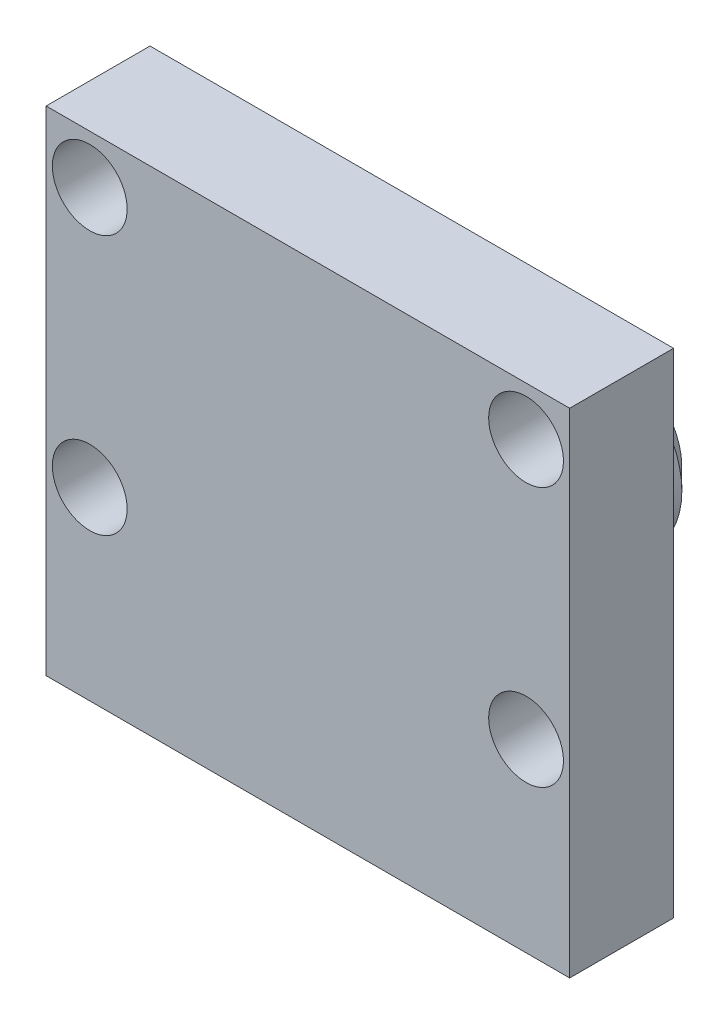
ISO-10303-21;
HEADER;
FILE_DESCRIPTION(('STEP AP214'),'2;1');
FILE_NAME('part.step','',(''),(''),'','','');
FILE_SCHEMA(('AUTOMOTIVE_DESIGN { 1 0 10303 214 1 1 1 1 }'));
ENDSEC;
DATA;
#1=APPLICATION_CONTEXT('core data for automotive mechanical design processes');
#2=APPLICATION_PROTOCOL_DEFINITION('international standard','automotive_design',2000,#1);
#3=PRODUCT_CONTEXT('',#1,'mechanical');
#4=PRODUCT('Part','Part','',(#3));
#5=PRODUCT_RELATED_PRODUCT_CATEGORY('part','',(#4));
#6=PRODUCT_DEFINITION_FORMATION('','',#4);
#7=PRODUCT_DEFINITION_CONTEXT('part definition',#1,'design');
#8=PRODUCT_DEFINITION('design','',#6,#7);
#9=PRODUCT_DEFINITION_SHAPE('','',#8);
#10=(LENGTH_UNIT() NAMED_UNIT(*) SI_UNIT(.MILLI.,.METRE.));
#11=(NAMED_UNIT(*) PLANE_ANGLE_UNIT() SI_UNIT($,.RADIAN.));
#12=(NAMED_UNIT(*) SI_UNIT($,.STERADIAN.) SOLID_ANGLE_UNIT());
#13=UNCERTAINTY_MEASURE_WITH_UNIT(LENGTH_MEASURE(1.E-05),#10,'distance_accuracy_value','');
#14=(GEOMETRIC_REPRESENTATION_CONTEXT(3) GLOBAL_UNCERTAINTY_ASSIGNED_CONTEXT((#13)) GLOBAL_UNIT_ASSIGNED_CONTEXT((#10,
#11,#12)) REPRESENTATION_CONTEXT('',''));
#15=CARTESIAN_POINT('',(0.,0.,0.));
#16=DIRECTION('',(0.,0.,1.));
#17=DIRECTION('',(1.,0.,0.));
#18=AXIS2_PLACEMENT_3D('',#15,#16,#17);
#19=CARTESIAN_POINT('',(0.,39.,-1.92893218813452));
#20=DIRECTION('',(0.,0.,-1.));
#21=DIRECTION('',(-1.,0.,0.));
#22=AXIS2_PLACEMENT_3D('',#19,#20,#21);
#23=CYLINDRICAL_SURFACE('',#22,2.5);
#24=CARTESIAN_POINT('',(0.,39.,-9.));
#25=DIRECTION('',(0.,0.,-1.));
#26=DIRECTION('',(-1.,0.,0.));
#27=AXIS2_PLACEMENT_3D('',#24,#25,#26);
#28=CIRCLE('',#27,2.5);
#29=CARTESIAN_POINT('',(-2.5,39.,-9.));
#30=VERTEX_POINT('',#29);
#31=EDGE_CURVE('E11',#30,#30,#28,.F.);
#32=ORIENTED_EDGE('',*,*,#31,.F.);
#33=EDGE_LOOP('',(#32));
#34=FACE_BOUND('',#33,.T.);
#35=CARTESIAN_POINT('',(0.,39.,-10.));
#36=DIRECTION('',(0.,0.,-1.));
#37=DIRECTION('',(-1.,0.,0.));
#38=AXIS2_PLACEMENT_3D('',#35,#36,#37);
#39=CIRCLE('',#38,2.5);
#40=CARTESIAN_POINT('',(-2.5,39.,-10.));
#41=VERTEX_POINT('',#40);
#42=EDGE_CURVE('E53',#41,#41,#39,.T.);
#43=ORIENTED_EDGE('',*,*,#42,.F.);
#44=EDGE_LOOP('',(#43));
#45=FACE_BOUND('',#44,.T.);
#46=ADVANCED_FACE('F46',(#34,#45),#23,.T.);
#47=CARTESIAN_POINT('',(0.,39.,-10.));
#48=DIRECTION('',(0.,0.,-1.));
#49=DIRECTION('',(-1.,0.,0.));
#50=AXIS2_PLACEMENT_3D('',#47,#48,#49);
#51=PLANE('',#50);
#52=ORIENTED_EDGE('',*,*,#42,.T.);
#53=EDGE_LOOP('',(#52));
#54=FACE_BOUND('',#53,.T.);
#55=ADVANCED_FACE('F60',(#54),#51,.T.);
#56=CARTESIAN_POINT('',(0.,39.,-9.));
#57=DIRECTION('',(0.,0.,-1.));
#58=DIRECTION('',(-1.,0.,0.));
#59=AXIS2_PLACEMENT_3D('',#56,#57,#58);
#60=PLANE('',#59);
#61=ORIENTED_EDGE('',*,*,#31,.T.);
#62=EDGE_LOOP('',(#61));
#63=FACE_BOUND('',#62,.T.);
#64=ADVANCED_FACE('F67',(#63),#60,.F.);
#65=CLOSED_SHELL('',(#46,#55,#64));
#66=MANIFOLD_SOLID_BREP('B2',#65);
#67=CARTESIAN_POINT('',(0.,0.,0.));
#68=DIRECTION('',(0.,0.,-1.));
#69=DIRECTION('',(-1.,0.,0.));
#70=AXIS2_PLACEMENT_3D('',#67,#68,#69);
#71=PLANE('',#70);
#72=CARTESIAN_POINT('',(10.5,38.9,0.));
#73=DIRECTION('',(0.,0.,-1.));
#74=DIRECTION('',(-1.,0.,0.));
#75=AXIS2_PLACEMENT_3D('',#72,#73,#74);
#76=CIRCLE('',#75,1.8);
#77=CARTESIAN_POINT('',(8.7,38.9,0.));
#78=VERTEX_POINT('',#77);
#79=EDGE_CURVE('E181',#78,#78,#76,.T.);
#80=ORIENTED_EDGE('',*,*,#79,.F.);
#81=EDGE_LOOP('',(#80));
#82=FACE_BOUND('',#81,.T.);
#83=CARTESIAN_POINT('',(-10.5,38.9,0.));
#84=DIRECTION('',(0.,0.,-1.));
#85=DIRECTION('',(-1.,0.,0.));
#86=AXIS2_PLACEMENT_3D('',#83,#84,#85);
#87=CIRCLE('',#86,1.8);
#88=CARTESIAN_POINT('',(-12.3,38.9,0.));
#89=VERTEX_POINT('',#88);
#90=EDGE_CURVE('E227',#89,#89,#87,.T.);
#91=ORIENTED_EDGE('',*,*,#90,.F.);
#92=EDGE_LOOP('',(#91));
#93=FACE_BOUND('',#92,.T.);
#94=CARTESIAN_POINT('',(-10.5,51.4,0.));
#95=DIRECTION('',(0.,0.,-1.));
#96=DIRECTION('',(-1.,0.,0.));
#97=AXIS2_PLACEMENT_3D('',#94,#95,#96);
#98=CIRCLE('',#97,1.8);
#99=CARTESIAN_POINT('',(-12.3,51.4,0.));
#100=VERTEX_POINT('',#99);
#101=EDGE_CURVE('E219',#100,#100,#98,.T.);
#102=ORIENTED_EDGE('',*,*,#101,.F.);
#103=EDGE_LOOP('',(#102));
#104=FACE_BOUND('',#103,.T.);
#105=CARTESIAN_POINT('',(10.5,51.4,0.));
#106=DIRECTION('',(0.,0.,-1.));
#107=DIRECTION('',(-1.,0.,0.));
#108=AXIS2_PLACEMENT_3D('',#105,#106,#107);
#109=CIRCLE('',#108,1.8);
#110=CARTESIAN_POINT('',(8.7,51.4,0.));
#111=VERTEX_POINT('',#110);
#112=EDGE_CURVE('E218',#111,#111,#109,.T.);
#113=ORIENTED_EDGE('',*,*,#112,.F.);
#114=EDGE_LOOP('',(#113));
#115=FACE_BOUND('',#114,.T.);
#116=DIRECTION('',(0.,1.,0.));
#117=VECTOR('',#116,1.);
#118=CARTESIAN_POINT('',(12.6,30.,0.));
#119=LINE('',#118,#117);
#120=CARTESIAN_POINT('',(12.6,30.,0.));
#121=VERTEX_POINT('',#120);
#122=CARTESIAN_POINT('',(12.6,53.75,0.));
#123=VERTEX_POINT('',#122);
#124=EDGE_CURVE('E241',#121,#123,#119,.T.);
#125=ORIENTED_EDGE('',*,*,#124,.F.);
#126=DIRECTION('',(1.,0.,0.));
#127=VECTOR('',#126,1.);
#128=CARTESIAN_POINT('',(-12.6,30.,0.));
#129=LINE('',#128,#127);
#130=CARTESIAN_POINT('',(-12.6,30.,0.));
#131=VERTEX_POINT('',#130);
#132=EDGE_CURVE('E250',#131,#121,#129,.T.);
#133=ORIENTED_EDGE('',*,*,#132,.F.);
#134=DIRECTION('',(0.,-1.,0.));
#135=VECTOR('',#134,1.);
#136=CARTESIAN_POINT('',(-12.6,30.,0.));
#137=LINE('',#136,#135);
#138=CARTESIAN_POINT('',(-12.6,53.75,0.));
#139=VERTEX_POINT('',#138);
#140=EDGE_CURVE('E266',#139,#131,#137,.T.);
#141=ORIENTED_EDGE('',*,*,#140,.F.);
#142=DIRECTION('',(-1.,0.,0.));
#143=VECTOR('',#142,1.);
#144=CARTESIAN_POINT('',(-12.6,53.75,0.));
#145=LINE('',#144,#143);
#146=EDGE_CURVE('E263',#123,#139,#145,.T.);
#147=ORIENTED_EDGE('',*,*,#146,.F.);
#148=EDGE_LOOP('',(#125,#133,#141,#147));
#149=FACE_BOUND('',#148,.T.);
#150=DIRECTION('',(1.,0.,0.));
#151=VECTOR('',#150,1.);
#152=CARTESIAN_POINT('',(5.6,44.6,0.));
#153=LINE('',#152,#151);
#154=CARTESIAN_POINT('',(-5.6,44.6,0.));
#155=VERTEX_POINT('',#154);
#156=CARTESIAN_POINT('',(5.6,44.6,0.));
#157=VERTEX_POINT('',#156);
#158=EDGE_CURVE('E176',#155,#157,#153,.T.);
#159=ORIENTED_EDGE('',*,*,#158,.F.);
#160=DIRECTION('',(0.,1.,0.));
#161=VECTOR('',#160,1.);
#162=CARTESIAN_POINT('',(-5.6,33.4,0.));
#163=LINE('',#162,#161);
#164=CARTESIAN_POINT('',(-5.6,33.4,0.));
#165=VERTEX_POINT('',#164);
#166=EDGE_CURVE('E185',#165,#155,#163,.T.);
#167=ORIENTED_EDGE('',*,*,#166,.F.);
#168=DIRECTION('',(-1.,0.,0.));
#169=VECTOR('',#168,1.);
#170=CARTESIAN_POINT('',(5.6,33.4,0.));
#171=LINE('',#170,#169);
#172=CARTESIAN_POINT('',(5.6,33.4,0.));
#173=VERTEX_POINT('',#172);
#174=EDGE_CURVE('E201',#173,#165,#171,.T.);
#175=ORIENTED_EDGE('',*,*,#174,.F.);
#176=DIRECTION('',(0.,-1.,0.));
#177=VECTOR('',#176,1.);
#178=CARTESIAN_POINT('',(5.6,33.4,0.));
#179=LINE('',#178,#177);
#180=EDGE_CURVE('E195',#157,#173,#179,.T.);
#181=ORIENTED_EDGE('',*,*,#180,.F.);
#182=EDGE_LOOP('',(#159,#167,#175,#181));
#183=FACE_BOUND('',#182,.T.);
#184=ADVANCED_FACE('F91',(#82,#93,#104,#115,#149,#183),#71,.T.);
#185=CARTESIAN_POINT('',(12.6,30.,5.));
#186=DIRECTION('',(-1.,0.,0.));
#187=DIRECTION('',(0.,0.,1.));
#188=AXIS2_PLACEMENT_3D('',#185,#186,#187);
#189=PLANE('',#188);
#190=ORIENTED_EDGE('',*,*,#124,.T.);
#191=DIRECTION('',(0.,0.,-1.));
#192=VECTOR('',#191,1.);
#193=CARTESIAN_POINT('',(12.6,53.75,5.));
#194=LINE('',#193,#192);
#195=CARTESIAN_POINT('',(12.6,53.75,5.));
#196=VERTEX_POINT('',#195);
#197=EDGE_CURVE('E282',#196,#123,#194,.T.);
#198=ORIENTED_EDGE('',*,*,#197,.F.);
#199=DIRECTION('',(0.,1.,0.));
#200=VECTOR('',#199,1.);
#201=CARTESIAN_POINT('',(12.6,30.,5.));
#202=LINE('',#201,#200);
#203=CARTESIAN_POINT('',(12.6,30.,5.));
#204=VERTEX_POINT('',#203);
#205=EDGE_CURVE('E245',#204,#196,#202,.T.);
#206=ORIENTED_EDGE('',*,*,#205,.F.);
#207=DIRECTION('',(0.,0.,-1.));
#208=VECTOR('',#207,1.);
#209=CARTESIAN_POINT('',(12.6,30.,5.));
#210=LINE('',#209,#208);
#211=EDGE_CURVE('E259',#204,#121,#210,.T.);
#212=ORIENTED_EDGE('',*,*,#211,.T.);
#213=EDGE_LOOP('',(#190,#198,#206,#212));
#214=FACE_BOUND('',#213,.T.);
#215=ADVANCED_FACE('F360',(#214),#189,.F.);
#216=CARTESIAN_POINT('',(-12.6,53.75,5.));
#217=DIRECTION('',(0.,-1.,0.));
#218=DIRECTION('',(0.,0.,-1.));
#219=AXIS2_PLACEMENT_3D('',#216,#217,#218);
#220=PLANE('',#219);
#221=ORIENTED_EDGE('',*,*,#146,.T.);
#222=DIRECTION('',(0.,0.,-1.));
#223=VECTOR('',#222,1.);
#224=CARTESIAN_POINT('',(-12.6,53.75,5.));
#225=LINE('',#224,#223);
#226=CARTESIAN_POINT('',(-12.6,53.75,5.));
#227=VERTEX_POINT('',#226);
#228=EDGE_CURVE('E278',#227,#139,#225,.T.);
#229=ORIENTED_EDGE('',*,*,#228,.F.);
#230=DIRECTION('',(-1.,0.,0.));
#231=VECTOR('',#230,1.);
#232=CARTESIAN_POINT('',(-12.6,53.75,5.));
#233=LINE('',#232,#231);
#234=EDGE_CURVE('E249',#196,#227,#233,.T.);
#235=ORIENTED_EDGE('',*,*,#234,.F.);
#236=ORIENTED_EDGE('',*,*,#197,.T.);
#237=EDGE_LOOP('',(#221,#229,#235,#236));
#238=FACE_BOUND('',#237,.T.);
#239=ADVANCED_FACE('F366',(#238),#220,.F.);
#240=CARTESIAN_POINT('',(-12.6,30.,5.));
#241=DIRECTION('',(1.,0.,0.));
#242=DIRECTION('',(0.,0.,-1.));
#243=AXIS2_PLACEMENT_3D('',#240,#241,#242);
#244=PLANE('',#243);
#245=ORIENTED_EDGE('',*,*,#140,.T.);
#246=DIRECTION('',(0.,0.,-1.));
#247=VECTOR('',#246,1.);
#248=CARTESIAN_POINT('',(-12.6,30.,5.));
#249=LINE('',#248,#247);
#250=CARTESIAN_POINT('',(-12.6,30.,5.));
#251=VERTEX_POINT('',#250);
#252=EDGE_CURVE('E274',#251,#131,#249,.T.);
#253=ORIENTED_EDGE('',*,*,#252,.F.);
#254=DIRECTION('',(0.,-1.,0.));
#255=VECTOR('',#254,1.);
#256=CARTESIAN_POINT('',(-12.6,30.,5.));
#257=LINE('',#256,#255);
#258=EDGE_CURVE('E253',#227,#251,#257,.T.);
#259=ORIENTED_EDGE('',*,*,#258,.F.);
#260=ORIENTED_EDGE('',*,*,#228,.T.);
#261=EDGE_LOOP('',(#245,#253,#259,#260));
#262=FACE_BOUND('',#261,.T.);
#263=ADVANCED_FACE('F378',(#262),#244,.F.);
#264=CARTESIAN_POINT('',(-12.6,30.,5.));
#265=DIRECTION('',(0.,1.,0.));
#266=DIRECTION('',(0.,0.,1.));
#267=AXIS2_PLACEMENT_3D('',#264,#265,#266);
#268=PLANE('',#267);
#269=ORIENTED_EDGE('',*,*,#132,.T.);
#270=ORIENTED_EDGE('',*,*,#211,.F.);
#271=DIRECTION('',(1.,0.,0.));
#272=VECTOR('',#271,1.);
#273=CARTESIAN_POINT('',(-12.6,30.,5.));
#274=LINE('',#273,#272);
#275=EDGE_CURVE('E256',#251,#204,#274,.T.);
#276=ORIENTED_EDGE('',*,*,#275,.F.);
#277=ORIENTED_EDGE('',*,*,#252,.T.);
#278=EDGE_LOOP('',(#269,#270,#276,#277));
#279=FACE_BOUND('',#278,.T.);
#280=ADVANCED_FACE('F375',(#279),#268,.F.);
#281=CARTESIAN_POINT('',(0.,0.,5.));
#282=DIRECTION('',(0.,0.,-1.));
#283=DIRECTION('',(-1.,0.,0.));
#284=AXIS2_PLACEMENT_3D('',#281,#282,#283);
#285=PLANE('',#284);
#286=CARTESIAN_POINT('',(10.5,38.9,5.));
#287=DIRECTION('',(0.,0.,-1.));
#288=DIRECTION('',(-1.,0.,0.));
#289=AXIS2_PLACEMENT_3D('',#286,#287,#288);
#290=CIRCLE('',#289,1.8);
#291=CARTESIAN_POINT('',(8.7,38.9,5.));
#292=VERTEX_POINT('',#291);
#293=EDGE_CURVE('E230',#292,#292,#290,.T.);
#294=ORIENTED_EDGE('',*,*,#293,.T.);
#295=EDGE_LOOP('',(#294));
#296=FACE_BOUND('',#295,.T.);
#297=CARTESIAN_POINT('',(-10.5,38.9,5.));
#298=DIRECTION('',(0.,0.,-1.));
#299=DIRECTION('',(-1.,0.,0.));
#300=AXIS2_PLACEMENT_3D('',#297,#298,#299);
#301=CIRCLE('',#300,1.8);
#302=CARTESIAN_POINT('',(-12.3,38.9,5.));
#303=VERTEX_POINT('',#302);
#304=EDGE_CURVE('E223',#303,#303,#301,.T.);
#305=ORIENTED_EDGE('',*,*,#304,.T.);
#306=EDGE_LOOP('',(#305));
#307=FACE_BOUND('',#306,.T.);
#308=CARTESIAN_POINT('',(-10.5,51.4,5.));
#309=DIRECTION('',(0.,0.,-1.));
#310=DIRECTION('',(-1.,0.,0.));
#311=AXIS2_PLACEMENT_3D('',#308,#309,#310);
#312=CIRCLE('',#311,1.8);
#313=CARTESIAN_POINT('',(-12.3,51.4,5.));
#314=VERTEX_POINT('',#313);
#315=EDGE_CURVE('E214',#314,#314,#312,.T.);
#316=ORIENTED_EDGE('',*,*,#315,.T.);
#317=EDGE_LOOP('',(#316));
#318=FACE_BOUND('',#317,.T.);
#319=CARTESIAN_POINT('',(10.5,51.4,5.));
#320=DIRECTION('',(0.,0.,-1.));
#321=DIRECTION('',(-1.,0.,0.));
#322=AXIS2_PLACEMENT_3D('',#319,#320,#321);
#323=CIRCLE('',#322,1.8);
#324=CARTESIAN_POINT('',(8.7,51.4,5.));
#325=VERTEX_POINT('',#324);
#326=EDGE_CURVE('E237',#325,#325,#323,.T.);
#327=ORIENTED_EDGE('',*,*,#326,.T.);
#328=EDGE_LOOP('',(#327));
#329=FACE_BOUND('',#328,.T.);
#330=ORIENTED_EDGE('',*,*,#205,.T.);
#331=ORIENTED_EDGE('',*,*,#234,.T.);
#332=ORIENTED_EDGE('',*,*,#258,.T.);
#333=ORIENTED_EDGE('',*,*,#275,.T.);
#334=EDGE_LOOP('',(#330,#331,#332,#333));
#335=FACE_BOUND('',#334,.T.);
#336=ADVANCED_FACE('F373',(#296,#307,#318,#329,#335),#285,.F.);
#337=CARTESIAN_POINT('',(10.5,51.4,5.));
#338=DIRECTION('',(0.,0.,-1.));
#339=DIRECTION('',(-1.,0.,0.));
#340=AXIS2_PLACEMENT_3D('',#337,#338,#339);
#341=CYLINDRICAL_SURFACE('',#340,1.8);
#342=ORIENTED_EDGE('',*,*,#326,.F.);
#343=EDGE_LOOP('',(#342));
#344=FACE_BOUND('',#343,.T.);
#345=ORIENTED_EDGE('',*,*,#112,.T.);
#346=EDGE_LOOP('',(#345));
#347=FACE_BOUND('',#346,.T.);
#348=ADVANCED_FACE('F436',(#344,#347),#341,.F.);
#349=CARTESIAN_POINT('',(-10.5,51.4,5.));
#350=DIRECTION('',(0.,0.,-1.));
#351=DIRECTION('',(-1.,0.,0.));
#352=AXIS2_PLACEMENT_3D('',#349,#350,#351);
#353=CYLINDRICAL_SURFACE('',#352,1.8);
#354=ORIENTED_EDGE('',*,*,#315,.F.);
#355=EDGE_LOOP('',(#354));
#356=FACE_BOUND('',#355,.T.);
#357=ORIENTED_EDGE('',*,*,#101,.T.);
#358=EDGE_LOOP('',(#357));
#359=FACE_BOUND('',#358,.T.);
#360=ADVANCED_FACE('F432',(#356,#359),#353,.F.);
#361=CARTESIAN_POINT('',(-10.5,38.9,5.));
#362=DIRECTION('',(0.,0.,-1.));
#363=DIRECTION('',(-1.,0.,0.));
#364=AXIS2_PLACEMENT_3D('',#361,#362,#363);
#365=CYLINDRICAL_SURFACE('',#364,1.8);
#366=ORIENTED_EDGE('',*,*,#304,.F.);
#367=EDGE_LOOP('',(#366));
#368=FACE_BOUND('',#367,.T.);
#369=ORIENTED_EDGE('',*,*,#90,.T.);
#370=EDGE_LOOP('',(#369));
#371=FACE_BOUND('',#370,.T.);
#372=ADVANCED_FACE('F435',(#368,#371),#365,.F.);
#373=CARTESIAN_POINT('',(10.5,38.9,5.));
#374=DIRECTION('',(0.,0.,-1.));
#375=DIRECTION('',(-1.,0.,0.));
#376=AXIS2_PLACEMENT_3D('',#373,#374,#375);
#377=CYLINDRICAL_SURFACE('',#376,1.8);
#378=ORIENTED_EDGE('',*,*,#293,.F.);
#379=EDGE_LOOP('',(#378));
#380=FACE_BOUND('',#379,.T.);
#381=ORIENTED_EDGE('',*,*,#79,.T.);
#382=EDGE_LOOP('',(#381));
#383=FACE_BOUND('',#382,.T.);
#384=ADVANCED_FACE('F431',(#380,#383),#377,.F.);
#385=CARTESIAN_POINT('',(-5.6,33.4,-6.));
#386=DIRECTION('',(1.,0.,0.));
#387=DIRECTION('',(0.,0.,-1.));
#388=AXIS2_PLACEMENT_3D('',#385,#386,#387);
#389=PLANE('',#388);
#390=DIRECTION('',(0.,0.,1.));
#391=VECTOR('',#390,1.);
#392=CARTESIAN_POINT('',(-5.6,44.6,-6.));
#393=LINE('',#392,#391);
#394=CARTESIAN_POINT('',(-5.6,44.6,-4.99999999999999));
#395=VERTEX_POINT('',#394);
#396=EDGE_CURVE('E171',#395,#155,#393,.T.);
#397=ORIENTED_EDGE('',*,*,#396,.F.);
#398=DIRECTION('',(0.,-1.,0.));
#399=VECTOR('',#398,1.);
#400=CARTESIAN_POINT('',(-5.6,33.4,-4.99999999999999));
#401=LINE('',#400,#399);
#402=CARTESIAN_POINT('',(-5.6,33.4,-4.99999999999999));
#403=VERTEX_POINT('',#402);
#404=EDGE_CURVE('E116',#395,#403,#401,.T.);
#405=ORIENTED_EDGE('',*,*,#404,.T.);
#406=DIRECTION('',(0.,0.,1.));
#407=VECTOR('',#406,1.);
#408=CARTESIAN_POINT('',(-5.6,33.4,-6.));
#409=LINE('',#408,#407);
#410=EDGE_CURVE('E187',#403,#165,#409,.T.);
#411=ORIENTED_EDGE('',*,*,#410,.T.);
#412=ORIENTED_EDGE('',*,*,#166,.T.);
#413=EDGE_LOOP('',(#397,#405,#411,#412));
#414=FACE_BOUND('',#413,.T.);
#415=ADVANCED_FACE('F186',(#414),#389,.F.);
#416=CARTESIAN_POINT('',(5.6,44.6,-6.));
#417=DIRECTION('',(0.,-1.,0.));
#418=DIRECTION('',(0.,0.,-1.));
#419=AXIS2_PLACEMENT_3D('',#416,#417,#418);
#420=PLANE('',#419);
#421=DIRECTION('',(0.,0.,1.));
#422=VECTOR('',#421,1.);
#423=CARTESIAN_POINT('',(5.6,44.6,-6.));
#424=LINE('',#423,#422);
#425=CARTESIAN_POINT('',(5.6,44.6,-4.99999999999999));
#426=VERTEX_POINT('',#425);
#427=EDGE_CURVE('E182',#426,#157,#424,.T.);
#428=ORIENTED_EDGE('',*,*,#427,.F.);
#429=DIRECTION('',(-1.,0.,0.));
#430=VECTOR('',#429,1.);
#431=CARTESIAN_POINT('',(5.6,44.6,-4.99999999999999));
#432=LINE('',#431,#430);
#433=EDGE_CURVE('E179',#426,#395,#432,.T.);
#434=ORIENTED_EDGE('',*,*,#433,.T.);
#435=ORIENTED_EDGE('',*,*,#396,.T.);
#436=ORIENTED_EDGE('',*,*,#158,.T.);
#437=EDGE_LOOP('',(#428,#434,#435,#436));
#438=FACE_BOUND('',#437,.T.);
#439=ADVANCED_FACE('F174',(#438),#420,.F.);
#440=CARTESIAN_POINT('',(5.6,33.4,-6.));
#441=DIRECTION('',(-1.,0.,0.));
#442=DIRECTION('',(0.,0.,1.));
#443=AXIS2_PLACEMENT_3D('',#440,#441,#442);
#444=PLANE('',#443);
#445=DIRECTION('',(0.,0.,1.));
#446=VECTOR('',#445,1.);
#447=CARTESIAN_POINT('',(5.6,33.4,-6.));
#448=LINE('',#447,#446);
#449=CARTESIAN_POINT('',(5.6,33.4,-4.99999999999999));
#450=VERTEX_POINT('',#449);
#451=EDGE_CURVE('E209',#450,#173,#448,.T.);
#452=ORIENTED_EDGE('',*,*,#451,.F.);
#453=DIRECTION('',(0.,1.,0.));
#454=VECTOR('',#453,1.);
#455=CARTESIAN_POINT('',(5.6,33.4,-4.99999999999999));
#456=LINE('',#455,#454);
#457=EDGE_CURVE('E102',#450,#426,#456,.T.);
#458=ORIENTED_EDGE('',*,*,#457,.T.);
#459=ORIENTED_EDGE('',*,*,#427,.T.);
#460=ORIENTED_EDGE('',*,*,#180,.T.);
#461=EDGE_LOOP('',(#452,#458,#459,#460));
#462=FACE_BOUND('',#461,.T.);
#463=ADVANCED_FACE('F357',(#462),#444,.F.);
#464=CARTESIAN_POINT('',(5.6,33.4,-6.));
#465=DIRECTION('',(0.,1.,0.));
#466=DIRECTION('',(0.,0.,1.));
#467=AXIS2_PLACEMENT_3D('',#464,#465,#466);
#468=PLANE('',#467);
#469=ORIENTED_EDGE('',*,*,#410,.F.);
#470=DIRECTION('',(1.,0.,0.));
#471=VECTOR('',#470,1.);
#472=CARTESIAN_POINT('',(5.6,33.4,-4.99999999999999));
#473=LINE('',#472,#471);
#474=EDGE_CURVE('E44',#403,#450,#473,.T.);
#475=ORIENTED_EDGE('',*,*,#474,.T.);
#476=ORIENTED_EDGE('',*,*,#451,.T.);
#477=ORIENTED_EDGE('',*,*,#174,.T.);
#478=EDGE_LOOP('',(#469,#475,#476,#477));
#479=FACE_BOUND('',#478,.T.);
#480=ADVANCED_FACE('F347',(#479),#468,.F.);
#481=CARTESIAN_POINT('',(0.,0.,-6.));
#482=DIRECTION('',(0.,0.,1.));
#483=DIRECTION('',(1.,0.,0.));
#484=AXIS2_PLACEMENT_3D('',#481,#482,#483);
#485=PLANE('',#484);
#486=DIRECTION('',(0.,1.,0.));
#487=VECTOR('',#486,1.);
#488=CARTESIAN_POINT('',(-4.6,0.,-6.));
#489=LINE('',#488,#487);
#490=CARTESIAN_POINT('',(-4.6,34.4,-6.));
#491=VERTEX_POINT('',#490);
#492=CARTESIAN_POINT('',(-4.6,43.6,-6.));
#493=VERTEX_POINT('',#492);
#494=EDGE_CURVE('E301',#491,#493,#489,.T.);
#495=ORIENTED_EDGE('',*,*,#494,.T.);
#496=DIRECTION('',(1.,0.,0.));
#497=VECTOR('',#496,1.);
#498=CARTESIAN_POINT('',(0.,43.6,-6.));
#499=LINE('',#498,#497);
#500=CARTESIAN_POINT('',(4.6,43.6,-6.));
#501=VERTEX_POINT('',#500);
#502=EDGE_CURVE('E304',#493,#501,#499,.T.);
#503=ORIENTED_EDGE('',*,*,#502,.T.);
#504=DIRECTION('',(0.,-1.,0.));
#505=VECTOR('',#504,1.);
#506=CARTESIAN_POINT('',(4.6,0.,-6.));
#507=LINE('',#506,#505);
#508=CARTESIAN_POINT('',(4.6,34.4,-6.));
#509=VERTEX_POINT('',#508);
#510=EDGE_CURVE('E298',#501,#509,#507,.T.);
#511=ORIENTED_EDGE('',*,*,#510,.T.);
#512=DIRECTION('',(-1.,0.,0.));
#513=VECTOR('',#512,1.);
#514=CARTESIAN_POINT('',(0.,34.4,-6.));
#515=LINE('',#514,#513);
#516=EDGE_CURVE('E295',#509,#491,#515,.T.);
#517=ORIENTED_EDGE('',*,*,#516,.T.);
#518=EDGE_LOOP('',(#495,#503,#511,#517));
#519=FACE_BOUND('',#518,.T.);
#520=CARTESIAN_POINT('',(0.,39.,-6.));
#521=DIRECTION('',(0.,0.,-1.));
#522=DIRECTION('',(-1.,0.,0.));
#523=AXIS2_PLACEMENT_3D('',#520,#521,#522);
#524=CIRCLE('',#523,4.);
#525=CARTESIAN_POINT('',(-4.,39.,-6.));
#526=VERTEX_POINT('',#525);
#527=EDGE_CURVE('E286',#526,#526,#524,.T.);
#528=ORIENTED_EDGE('',*,*,#527,.F.);
#529=EDGE_LOOP('',(#528));
#530=FACE_BOUND('',#529,.T.);
#531=ADVANCED_FACE('F345',(#519,#530),#485,.F.);
#532=CARTESIAN_POINT('',(0.,39.,-10.));
#533=DIRECTION('',(0.,0.,1.));
#534=DIRECTION('',(1.,0.,0.));
#535=AXIS2_PLACEMENT_3D('',#532,#533,#534);
#536=CYLINDRICAL_SURFACE('',#535,4.);
#537=CARTESIAN_POINT('',(0.,39.,-9.));
#538=DIRECTION('',(0.,0.,-1.));
#539=DIRECTION('',(-1.,0.,0.));
#540=AXIS2_PLACEMENT_3D('',#537,#538,#539);
#541=CIRCLE('',#540,4.);
#542=CARTESIAN_POINT('',(-4.,39.,-9.));
#543=VERTEX_POINT('',#542);
#544=EDGE_CURVE('E291',#543,#543,#541,.F.);
#545=ORIENTED_EDGE('',*,*,#544,.T.);
#546=EDGE_LOOP('',(#545));
#547=FACE_BOUND('',#546,.T.);
#548=ORIENTED_EDGE('',*,*,#527,.T.);
#549=EDGE_LOOP('',(#548));
#550=FACE_BOUND('',#549,.T.);
#551=ADVANCED_FACE('F343',(#547,#550),#536,.T.);
#552=CARTESIAN_POINT('',(0.,39.,-10.));
#553=DIRECTION('',(0.,0.,-1.));
#554=DIRECTION('',(-1.,0.,0.));
#555=AXIS2_PLACEMENT_3D('',#552,#553,#554);
#556=PLANE('',#555);
#557=CARTESIAN_POINT('',(0.,39.,-10.));
#558=DIRECTION('',(0.,0.,-1.));
#559=DIRECTION('',(-1.,0.,0.));
#560=AXIS2_PLACEMENT_3D('',#557,#558,#559);
#561=CIRCLE('',#560,3.);
#562=CARTESIAN_POINT('',(-3.,39.,-10.));
#563=VERTEX_POINT('',#562);
#564=EDGE_CURVE('E287',#563,#563,#561,.T.);
#565=ORIENTED_EDGE('',*,*,#564,.T.);
#566=EDGE_LOOP('',(#565));
#567=FACE_BOUND('',#566,.T.);
#568=CARTESIAN_POINT('',(0.,39.,-10.));
#569=DIRECTION('',(0.,0.,-1.));
#570=DIRECTION('',(-1.,0.,0.));
#571=AXIS2_PLACEMENT_3D('',#568,#569,#570);
#572=CIRCLE('',#571,2.5);
#573=CARTESIAN_POINT('',(-2.5,39.,-10.));
#574=VERTEX_POINT('',#573);
#575=EDGE_CURVE('E328',#574,#574,#572,.T.);
#576=ORIENTED_EDGE('',*,*,#575,.F.);
#577=EDGE_LOOP('',(#576));
#578=FACE_BOUND('',#577,.T.);
#579=ADVANCED_FACE('F354',(#567,#578),#556,.T.);
#580=CARTESIAN_POINT('',(0.,39.,-9.));
#581=DIRECTION('',(0.,0.,-1.));
#582=DIRECTION('',(-1.,0.,0.));
#583=AXIS2_PLACEMENT_3D('',#580,#581,#582);
#584=CYLINDRICAL_SURFACE('',#583,2.5);
#585=CARTESIAN_POINT('',(0.,39.,-9.));
#586=DIRECTION('',(0.,0.,-1.));
#587=DIRECTION('',(-1.,0.,0.));
#588=AXIS2_PLACEMENT_3D('',#585,#586,#587);
#589=CIRCLE('',#588,2.5);
#590=CARTESIAN_POINT('',(-2.5,39.,-9.));
#591=VERTEX_POINT('',#590);
#592=EDGE_CURVE('E192',#591,#591,#589,.T.);
#593=ORIENTED_EDGE('',*,*,#592,.F.);
#594=EDGE_LOOP('',(#593));
#595=FACE_BOUND('',#594,.T.);
#596=ORIENTED_EDGE('',*,*,#575,.T.);
#597=EDGE_LOOP('',(#596));
#598=FACE_BOUND('',#597,.T.);
#599=ADVANCED_FACE('F506',(#595,#598),#584,.F.);
#600=CARTESIAN_POINT('',(0.,39.,-9.));
#601=DIRECTION('',(0.,0.,-1.));
#602=DIRECTION('',(-1.,0.,0.));
#603=AXIS2_PLACEMENT_3D('',#600,#601,#602);
#604=PLANE('',#603);
#605=ORIENTED_EDGE('',*,*,#592,.T.);
#606=EDGE_LOOP('',(#605));
#607=FACE_BOUND('',#606,.T.);
#608=ADVANCED_FACE('F392',(#607),#604,.T.);
#609=CARTESIAN_POINT('',(0.,39.,-10.));
#610=DIRECTION('',(0.,0.,1.));
#611=DIRECTION('',(1.,0.,0.));
#612=AXIS2_PLACEMENT_3D('',#609,#610,#611);
#613=CONICAL_SURFACE('',#612,3.,0.785398163397447);
#614=ORIENTED_EDGE('',*,*,#544,.F.);
#615=EDGE_LOOP('',(#614));
#616=FACE_BOUND('',#615,.T.);
#617=ORIENTED_EDGE('',*,*,#564,.F.);
#618=EDGE_LOOP('',(#617));
#619=FACE_BOUND('',#618,.T.);
#620=ADVANCED_FACE('F387',(#616,#619),#613,.T.);
#621=CARTESIAN_POINT('',(0.,34.4,-6.));
#622=DIRECTION('',(0.,0.70710678118655,0.707106781186545));
#623=DIRECTION('',(-1.,0.,0.));
#624=AXIS2_PLACEMENT_3D('',#621,#622,#623);
#625=PLANE('',#624);
#626=DIRECTION('',(0.577350269189624,-0.577350269189624,0.577350269189628));
#627=VECTOR('',#626,1.);
#628=CARTESIAN_POINT('',(3.06666666666667,35.9333333333333,-7.53333333333334));
#629=LINE('',#628,#627);
#630=EDGE_CURVE('E319',#450,#509,#629,.F.);
#631=ORIENTED_EDGE('',*,*,#630,.F.);
#632=ORIENTED_EDGE('',*,*,#474,.F.);
#633=DIRECTION('',(0.577350269189624,0.577350269189624,-0.577350269189628));
#634=VECTOR('',#633,1.);
#635=CARTESIAN_POINT('',(-3.06666666666667,35.9333333333333,-7.53333333333334));
#636=LINE('',#635,#634);
#637=EDGE_CURVE('E96',#491,#403,#636,.F.);
#638=ORIENTED_EDGE('',*,*,#637,.F.);
#639=ORIENTED_EDGE('',*,*,#516,.F.);
#640=EDGE_LOOP('',(#631,#632,#638,#639));
#641=FACE_BOUND('',#640,.T.);
#642=ADVANCED_FACE('F94',(#641),#625,.F.);
#643=CARTESIAN_POINT('',(-4.6,0.,-6.));
#644=DIRECTION('',(0.70710678118655,0.,0.707106781186545));
#645=DIRECTION('',(0.,1.,0.));
#646=AXIS2_PLACEMENT_3D('',#643,#644,#645);
#647=PLANE('',#646);
#648=ORIENTED_EDGE('',*,*,#637,.T.);
#649=ORIENTED_EDGE('',*,*,#404,.F.);
#650=DIRECTION('',(0.577350269189624,-0.577350269189624,-0.577350269189628));
#651=VECTOR('',#650,1.);
#652=CARTESIAN_POINT('',(9.93333333333327,29.0666666666667,-20.5333333333334));
#653=LINE('',#652,#651);
#654=EDGE_CURVE('E317',#493,#395,#653,.F.);
#655=ORIENTED_EDGE('',*,*,#654,.F.);
#656=ORIENTED_EDGE('',*,*,#494,.F.);
#657=EDGE_LOOP('',(#648,#649,#655,#656));
#658=FACE_BOUND('',#657,.T.);
#659=ADVANCED_FACE('F407',(#658),#647,.F.);
#660=CARTESIAN_POINT('',(4.6,0.,-6.));
#661=DIRECTION('',(-0.70710678118655,0.,0.707106781186545));
#662=DIRECTION('',(0.,-1.,0.));
#663=AXIS2_PLACEMENT_3D('',#660,#661,#662);
#664=PLANE('',#663);
#665=ORIENTED_EDGE('',*,*,#630,.T.);
#666=ORIENTED_EDGE('',*,*,#510,.F.);
#667=DIRECTION('',(0.577350269189624,0.577350269189624,0.577350269189628));
#668=VECTOR('',#667,1.);
#669=CARTESIAN_POINT('',(-9.93333333333327,29.0666666666667,-20.5333333333334));
#670=LINE('',#669,#668);
#671=EDGE_CURVE('E314',#426,#501,#670,.F.);
#672=ORIENTED_EDGE('',*,*,#671,.F.);
#673=ORIENTED_EDGE('',*,*,#457,.F.);
#674=EDGE_LOOP('',(#665,#666,#672,#673));
#675=FACE_BOUND('',#674,.T.);
#676=ADVANCED_FACE('F401',(#675),#664,.F.);
#677=CARTESIAN_POINT('',(0.,43.6,-6.));
#678=DIRECTION('',(0.,-0.70710678118655,0.707106781186545));
#679=DIRECTION('',(1.,0.,0.));
#680=AXIS2_PLACEMENT_3D('',#677,#678,#679);
#681=PLANE('',#680);
#682=ORIENTED_EDGE('',*,*,#654,.T.);
#683=ORIENTED_EDGE('',*,*,#433,.F.);
#684=ORIENTED_EDGE('',*,*,#671,.T.);
#685=ORIENTED_EDGE('',*,*,#502,.F.);
#686=EDGE_LOOP('',(#682,#683,#684,#685));
#687=FACE_BOUND('',#686,.T.);
#688=ADVANCED_FACE('F395',(#687),#681,.F.);
#689=CLOSED_SHELL('',(#184,#215,#239,#263,#280,#336,#348,#360,#372,#384,#415,#439,#463,#480,
#531,#551,#579,#599,#608,#620,#642,#659,#676,#688));
#690=MANIFOLD_SOLID_BREP('B6',#689);
#691=ADVANCED_BREP_SHAPE_REPRESENTATION('',(#18,#66,#690),#14);
#692=SHAPE_DEFINITION_REPRESENTATION(#9,#691);
ENDSEC;
END-ISO-10303-21;
